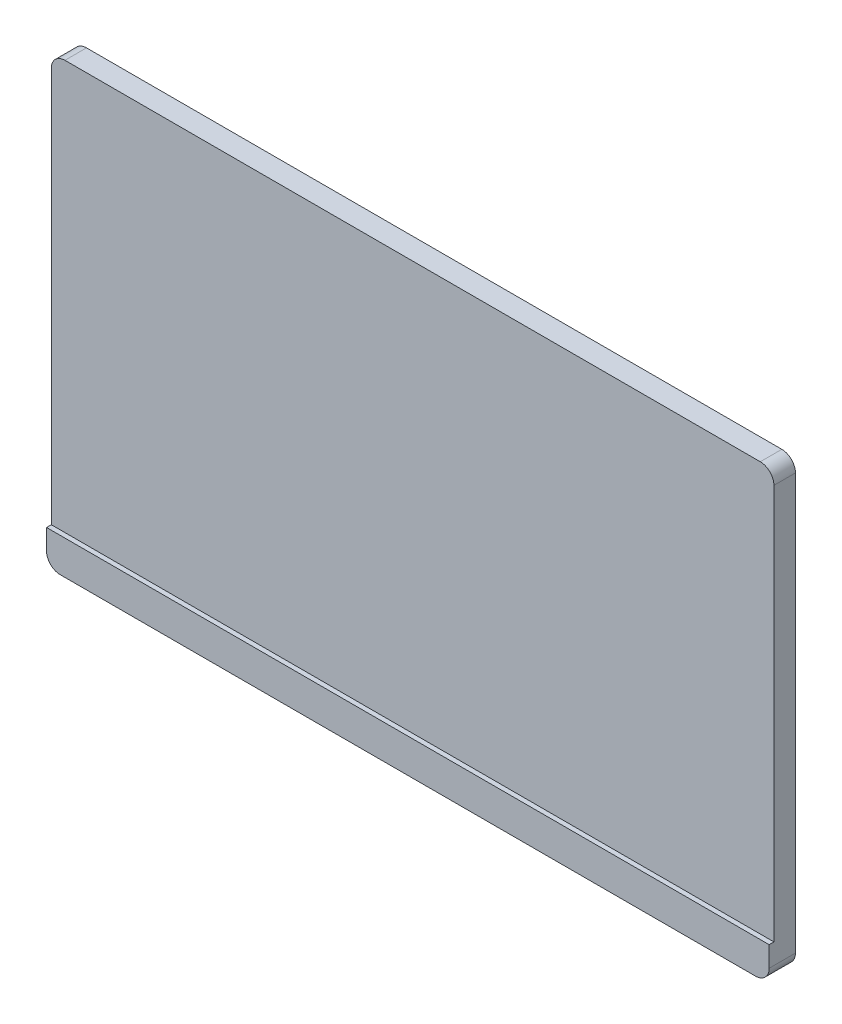
ISO-10303-21;
HEADER;
FILE_DESCRIPTION(('STEP AP214'),'2;1');
FILE_NAME('part.step','',(''),(''),'','','');
FILE_SCHEMA(('AUTOMOTIVE_DESIGN { 1 0 10303 214 1 1 1 1 }'));
ENDSEC;
DATA;
#1=APPLICATION_CONTEXT('core data for automotive mechanical design processes');
#2=APPLICATION_PROTOCOL_DEFINITION('international standard','automotive_design',2000,#1);
#3=PRODUCT_CONTEXT('',#1,'mechanical');
#4=PRODUCT('Part','Part','',(#3));
#5=PRODUCT_RELATED_PRODUCT_CATEGORY('part','',(#4));
#6=PRODUCT_DEFINITION_FORMATION('','',#4);
#7=PRODUCT_DEFINITION_CONTEXT('part definition',#1,'design');
#8=PRODUCT_DEFINITION('design','',#6,#7);
#9=PRODUCT_DEFINITION_SHAPE('','',#8);
#10=(LENGTH_UNIT() NAMED_UNIT(*) SI_UNIT(.MILLI.,.METRE.));
#11=(NAMED_UNIT(*) PLANE_ANGLE_UNIT() SI_UNIT($,.RADIAN.));
#12=(NAMED_UNIT(*) SI_UNIT($,.STERADIAN.) SOLID_ANGLE_UNIT());
#13=UNCERTAINTY_MEASURE_WITH_UNIT(LENGTH_MEASURE(1.E-05),#10,'distance_accuracy_value','');
#14=(GEOMETRIC_REPRESENTATION_CONTEXT(3) GLOBAL_UNCERTAINTY_ASSIGNED_CONTEXT((#13)) GLOBAL_UNIT_ASSIGNED_CONTEXT((#10,
#11,#12)) REPRESENTATION_CONTEXT('',''));
#15=CARTESIAN_POINT('',(0.,0.,0.));
#16=DIRECTION('',(0.,0.,1.));
#17=DIRECTION('',(1.,0.,0.));
#18=AXIS2_PLACEMENT_3D('',#15,#16,#17);
#19=CARTESIAN_POINT('',(0.,0.,15.8));
#20=DIRECTION('',(0.,1.,0.));
#21=DIRECTION('',(0.,0.,1.));
#22=AXIS2_PLACEMENT_3D('',#19,#20,#21);
#23=PLANE('',#22);
#24=CARTESIAN_POINT('',(530.,0.,-111.562410900628));
#25=DIRECTION('',(0.,1.,0.));
#26=DIRECTION('',(0.,0.,-1.));
#27=AXIS2_PLACEMENT_3D('',#24,#25,#26);
#28=CIRCLE('',#27,111.562410900628);
#29=CARTESIAN_POINT('',(475.,0.,-14.4996913531077));
#30=VERTEX_POINT('',#29);
#31=CARTESIAN_POINT('',(520.,0.,-0.44908350035365));
#32=VERTEX_POINT('',#31);
#33=EDGE_CURVE('E178',#30,#32,#28,.T.);
#34=ORIENTED_EDGE('',*,*,#33,.T.);
#35=DIRECTION('',(0.,0.,-1.));
#36=VECTOR('',#35,1.);
#37=CARTESIAN_POINT('',(520.,0.,15.8));
#38=LINE('',#37,#36);
#39=CARTESIAN_POINT('',(520.,0.,19.3));
#40=VERTEX_POINT('',#39);
#41=EDGE_CURVE('E363',#32,#40,#38,.F.);
#42=ORIENTED_EDGE('',*,*,#41,.T.);
#43=DIRECTION('',(1.,0.,0.));
#44=VECTOR('',#43,1.);
#45=CARTESIAN_POINT('',(0.,0.,19.3));
#46=LINE('',#45,#44);
#47=CARTESIAN_POINT('',(10.,0.,19.3));
#48=VERTEX_POINT('',#47);
#49=EDGE_CURVE('E206',#48,#40,#46,.T.);
#50=ORIENTED_EDGE('',*,*,#49,.F.);
#51=DIRECTION('',(0.,0.,-1.));
#52=VECTOR('',#51,1.);
#53=CARTESIAN_POINT('',(10.,0.,15.8));
#54=LINE('',#53,#52);
#55=CARTESIAN_POINT('',(10.,0.,-0.462525831437299));
#56=VERTEX_POINT('',#55);
#57=EDGE_CURVE('E154',#48,#56,#54,.T.);
#58=ORIENTED_EDGE('',*,*,#57,.T.);
#59=CARTESIAN_POINT('',(0.,0.,-108.333333333334));
#60=DIRECTION('',(0.,1.,0.));
#61=DIRECTION('',(0.,0.,1.));
#62=AXIS2_PLACEMENT_3D('',#59,#60,#61);
#63=CIRCLE('',#62,108.333333333333);
#64=CARTESIAN_POINT('',(55.,0.,-15.));
#65=VERTEX_POINT('',#64);
#66=EDGE_CURVE('E145',#56,#65,#63,.T.);
#67=ORIENTED_EDGE('',*,*,#66,.T.);
#68=CARTESIAN_POINT('',(110.,0.,78.3333333333334));
#69=DIRECTION('',(0.,-1.,0.));
#70=DIRECTION('',(0.,0.,-1.));
#71=AXIS2_PLACEMENT_3D('',#68,#69,#70);
#72=CIRCLE('',#71,108.333333333333);
#73=CARTESIAN_POINT('',(110.,0.,-30.));
#74=VERTEX_POINT('',#73);
#75=EDGE_CURVE('E150',#65,#74,#72,.T.);
#76=ORIENTED_EDGE('',*,*,#75,.T.);
#77=DIRECTION('',(-1.,0.,0.));
#78=VECTOR('',#77,1.);
#79=CARTESIAN_POINT('',(530.,0.,-30.));
#80=LINE('',#79,#78);
#81=CARTESIAN_POINT('',(420.,0.,-30.));
#82=VERTEX_POINT('',#81);
#83=EDGE_CURVE('E196',#82,#74,#80,.T.);
#84=ORIENTED_EDGE('',*,*,#83,.F.);
#85=CARTESIAN_POINT('',(415.943924500506,0.,89.7210958066118));
#86=DIRECTION('',(0.,-1.,0.));
#87=DIRECTION('',(0.,0.,1.));
#88=AXIS2_PLACEMENT_3D('',#85,#86,#87);
#89=CIRCLE('',#88,119.78978474642);
#90=EDGE_CURVE('E180',#82,#30,#89,.T.);
#91=ORIENTED_EDGE('',*,*,#90,.T.);
#92=EDGE_LOOP('',(#34,#42,#50,#58,#67,#76,#84,#91));
#93=FACE_BOUND('',#92,.T.);
#94=ADVANCED_FACE('F37',(#93),#23,.F.);
#95=CARTESIAN_POINT('',(530.,220.,-30.));
#96=DIRECTION('',(0.,-1.,0.));
#97=DIRECTION('',(0.,0.,-1.));
#98=AXIS2_PLACEMENT_3D('',#95,#96,#97);
#99=PLANE('',#98);
#100=CARTESIAN_POINT('',(110.,220.,78.3333333333334));
#101=DIRECTION('',(0.,-1.,0.));
#102=DIRECTION('',(0.,0.,-1.));
#103=AXIS2_PLACEMENT_3D('',#100,#101,#102);
#104=CIRCLE('',#103,108.333333333333);
#105=CARTESIAN_POINT('',(55.,220.,-15.));
#106=VERTEX_POINT('',#105);
#107=CARTESIAN_POINT('',(110.,220.,-30.));
#108=VERTEX_POINT('',#107);
#109=EDGE_CURVE('E156',#106,#108,#104,.T.);
#110=ORIENTED_EDGE('',*,*,#109,.F.);
#111=CARTESIAN_POINT('',(0.,220.,-108.333333333334));
#112=DIRECTION('',(0.,1.,0.));
#113=DIRECTION('',(0.,0.,1.));
#114=AXIS2_PLACEMENT_3D('',#111,#112,#113);
#115=CIRCLE('',#114,108.333333333333);
#116=CARTESIAN_POINT('',(0.,220.,0.));
#117=VERTEX_POINT('',#116);
#118=EDGE_CURVE('E163',#117,#106,#115,.T.);
#119=ORIENTED_EDGE('',*,*,#118,.F.);
#120=DIRECTION('',(1.,0.,0.));
#121=VECTOR('',#120,1.);
#122=CARTESIAN_POINT('',(530.,220.,0.));
#123=LINE('',#122,#121);
#124=CARTESIAN_POINT('',(530.,220.,0.));
#125=VERTEX_POINT('',#124);
#126=EDGE_CURVE('E191',#117,#125,#123,.T.);
#127=ORIENTED_EDGE('',*,*,#126,.T.);
#128=CARTESIAN_POINT('',(530.,220.,-111.562410900628));
#129=DIRECTION('',(0.,1.,0.));
#130=DIRECTION('',(0.,0.,-1.));
#131=AXIS2_PLACEMENT_3D('',#128,#129,#130);
#132=CIRCLE('',#131,111.562410900628);
#133=CARTESIAN_POINT('',(475.,220.,-14.4996913531077));
#134=VERTEX_POINT('',#133);
#135=EDGE_CURVE('E176',#134,#125,#132,.T.);
#136=ORIENTED_EDGE('',*,*,#135,.F.);
#137=CARTESIAN_POINT('',(415.943924500506,220.,89.7210958066118));
#138=DIRECTION('',(0.,-1.,0.));
#139=DIRECTION('',(0.,0.,1.));
#140=AXIS2_PLACEMENT_3D('',#137,#138,#139);
#141=CIRCLE('',#140,119.78978474642);
#142=CARTESIAN_POINT('',(420.,220.,-30.));
#143=VERTEX_POINT('',#142);
#144=EDGE_CURVE('E181',#143,#134,#141,.T.);
#145=ORIENTED_EDGE('',*,*,#144,.F.);
#146=DIRECTION('',(1.,0.,0.));
#147=VECTOR('',#146,1.);
#148=CARTESIAN_POINT('',(530.,220.,-30.));
#149=LINE('',#148,#147);
#150=EDGE_CURVE('E198',#108,#143,#149,.T.);
#151=ORIENTED_EDGE('',*,*,#150,.F.);
#152=EDGE_LOOP('',(#110,#119,#127,#136,#145,#151));
#153=FACE_BOUND('',#152,.T.);
#154=ADVANCED_FACE('F265',(#153),#99,.F.);
#155=CARTESIAN_POINT('',(0.,0.,15.8));
#156=DIRECTION('',(0.,0.,-1.));
#157=DIRECTION('',(-1.,0.,0.));
#158=AXIS2_PLACEMENT_3D('',#155,#156,#157);
#159=PLANE('',#158);
#160=DIRECTION('',(-1.,0.,0.));
#161=VECTOR('',#160,1.);
#162=CARTESIAN_POINT('',(0.,325.,15.8));
#163=LINE('',#162,#161);
#164=CARTESIAN_POINT('',(520.,325.,15.8));
#165=VERTEX_POINT('',#164);
#166=CARTESIAN_POINT('',(10.,325.,15.8));
#167=VERTEX_POINT('',#166);
#168=EDGE_CURVE('E227',#165,#167,#163,.T.);
#169=ORIENTED_EDGE('',*,*,#168,.T.);
#170=CARTESIAN_POINT('',(10.,315.,15.8));
#171=DIRECTION('',(0.,0.,-1.));
#172=DIRECTION('',(-1.,0.,0.));
#173=AXIS2_PLACEMENT_3D('',#170,#171,#172);
#174=CIRCLE('',#173,10.);
#175=CARTESIAN_POINT('',(0.,315.,15.8));
#176=VERTEX_POINT('',#175);
#177=EDGE_CURVE('E11',#167,#176,#174,.F.);
#178=ORIENTED_EDGE('',*,*,#177,.T.);
#179=DIRECTION('',(0.,-1.,0.));
#180=VECTOR('',#179,1.);
#181=CARTESIAN_POINT('',(0.,0.,15.8));
#182=LINE('',#181,#180);
#183=CARTESIAN_POINT('',(0.,25.,15.8));
#184=VERTEX_POINT('',#183);
#185=EDGE_CURVE('E222',#176,#184,#182,.T.);
#186=ORIENTED_EDGE('',*,*,#185,.T.);
#187=DIRECTION('',(-1.,0.,0.));
#188=VECTOR('',#187,1.);
#189=CARTESIAN_POINT('',(0.,25.,15.8));
#190=LINE('',#189,#188);
#191=CARTESIAN_POINT('',(530.,25.,15.8));
#192=VERTEX_POINT('',#191);
#193=EDGE_CURVE('E200',#192,#184,#190,.T.);
#194=ORIENTED_EDGE('',*,*,#193,.F.);
#195=DIRECTION('',(0.,1.,0.));
#196=VECTOR('',#195,1.);
#197=CARTESIAN_POINT('',(530.,0.,15.8));
#198=LINE('',#197,#196);
#199=CARTESIAN_POINT('',(530.,315.,15.8));
#200=VERTEX_POINT('',#199);
#201=EDGE_CURVE('E224',#192,#200,#198,.T.);
#202=ORIENTED_EDGE('',*,*,#201,.T.);
#203=CARTESIAN_POINT('',(520.,315.,15.8));
#204=DIRECTION('',(0.,0.,-1.));
#205=DIRECTION('',(-1.,0.,0.));
#206=AXIS2_PLACEMENT_3D('',#203,#204,#205);
#207=CIRCLE('',#206,10.);
#208=EDGE_CURVE('E45',#200,#165,#207,.F.);
#209=ORIENTED_EDGE('',*,*,#208,.T.);
#210=EDGE_LOOP('',(#169,#178,#186,#194,#202,#209));
#211=FACE_BOUND('',#210,.T.);
#212=ADVANCED_FACE('F268',(#211),#159,.F.);
#213=CARTESIAN_POINT('',(0.,0.,15.8));
#214=DIRECTION('',(1.,0.,0.));
#215=DIRECTION('',(0.,0.,-1.));
#216=AXIS2_PLACEMENT_3D('',#213,#214,#215);
#217=PLANE('',#216);
#218=DIRECTION('',(0.,1.,0.));
#219=VECTOR('',#218,1.);
#220=CARTESIAN_POINT('',(0.,0.,0.));
#221=LINE('',#220,#219);
#222=CARTESIAN_POINT('',(0.,10.,0.));
#223=VERTEX_POINT('',#222);
#224=EDGE_CURVE('E174',#223,#117,#221,.T.);
#225=ORIENTED_EDGE('',*,*,#224,.F.);
#226=DIRECTION('',(0.,0.,-1.));
#227=VECTOR('',#226,1.);
#228=CARTESIAN_POINT('',(0.,10.,15.8));
#229=LINE('',#228,#227);
#230=CARTESIAN_POINT('',(0.,10.,19.3));
#231=VERTEX_POINT('',#230);
#232=EDGE_CURVE('E299',#223,#231,#229,.F.);
#233=ORIENTED_EDGE('',*,*,#232,.T.);
#234=DIRECTION('',(0.,-1.,0.));
#235=VECTOR('',#234,1.);
#236=CARTESIAN_POINT('',(0.,0.,19.3));
#237=LINE('',#236,#235);
#238=CARTESIAN_POINT('',(0.,25.,19.3));
#239=VERTEX_POINT('',#238);
#240=EDGE_CURVE('E203',#239,#231,#237,.T.);
#241=ORIENTED_EDGE('',*,*,#240,.F.);
#242=DIRECTION('',(0.,0.,-1.));
#243=VECTOR('',#242,1.);
#244=CARTESIAN_POINT('',(0.,25.,19.3));
#245=LINE('',#244,#243);
#246=EDGE_CURVE('E213',#239,#184,#245,.T.);
#247=ORIENTED_EDGE('',*,*,#246,.T.);
#248=ORIENTED_EDGE('',*,*,#185,.F.);
#249=DIRECTION('',(0.,0.,-1.));
#250=VECTOR('',#249,1.);
#251=CARTESIAN_POINT('',(0.,315.,15.8));
#252=LINE('',#251,#250);
#253=CARTESIAN_POINT('',(0.,315.,0.));
#254=VERTEX_POINT('',#253);
#255=EDGE_CURVE('E308',#176,#254,#252,.T.);
#256=ORIENTED_EDGE('',*,*,#255,.T.);
#257=DIRECTION('',(0.,-1.,0.));
#258=VECTOR('',#257,1.);
#259=CARTESIAN_POINT('',(0.,0.,0.));
#260=LINE('',#259,#258);
#261=EDGE_CURVE('E221',#254,#117,#260,.T.);
#262=ORIENTED_EDGE('',*,*,#261,.T.);
#263=EDGE_LOOP('',(#225,#233,#241,#247,#248,#256,#262));
#264=FACE_BOUND('',#263,.T.);
#265=ADVANCED_FACE('F280',(#264),#217,.F.);
#266=CARTESIAN_POINT('',(530.,0.,15.8));
#267=DIRECTION('',(-1.,0.,0.));
#268=DIRECTION('',(0.,0.,1.));
#269=AXIS2_PLACEMENT_3D('',#266,#267,#268);
#270=PLANE('',#269);
#271=DIRECTION('',(0.,1.,0.));
#272=VECTOR('',#271,1.);
#273=CARTESIAN_POINT('',(530.,0.,19.3));
#274=LINE('',#273,#272);
#275=CARTESIAN_POINT('',(530.,10.,19.3));
#276=VERTEX_POINT('',#275);
#277=CARTESIAN_POINT('',(530.,25.,19.3));
#278=VERTEX_POINT('',#277);
#279=EDGE_CURVE('E209',#276,#278,#274,.T.);
#280=ORIENTED_EDGE('',*,*,#279,.F.);
#281=DIRECTION('',(0.,0.,-1.));
#282=VECTOR('',#281,1.);
#283=CARTESIAN_POINT('',(530.,10.,15.8));
#284=LINE('',#283,#282);
#285=CARTESIAN_POINT('',(530.,10.,0.));
#286=VERTEX_POINT('',#285);
#287=EDGE_CURVE('E236',#276,#286,#284,.T.);
#288=ORIENTED_EDGE('',*,*,#287,.T.);
#289=DIRECTION('',(0.,1.,0.));
#290=VECTOR('',#289,1.);
#291=CARTESIAN_POINT('',(530.,0.,0.));
#292=LINE('',#291,#290);
#293=EDGE_CURVE('E184',#286,#125,#292,.T.);
#294=ORIENTED_EDGE('',*,*,#293,.T.);
#295=DIRECTION('',(0.,1.,0.));
#296=VECTOR('',#295,1.);
#297=CARTESIAN_POINT('',(530.,0.,0.));
#298=LINE('',#297,#296);
#299=CARTESIAN_POINT('',(530.,315.,0.));
#300=VERTEX_POINT('',#299);
#301=EDGE_CURVE('E231',#125,#300,#298,.T.);
#302=ORIENTED_EDGE('',*,*,#301,.T.);
#303=DIRECTION('',(0.,0.,-1.));
#304=VECTOR('',#303,1.);
#305=CARTESIAN_POINT('',(530.,315.,15.8));
#306=LINE('',#305,#304);
#307=EDGE_CURVE('E229',#300,#200,#306,.F.);
#308=ORIENTED_EDGE('',*,*,#307,.T.);
#309=ORIENTED_EDGE('',*,*,#201,.F.);
#310=DIRECTION('',(0.,0.,-1.));
#311=VECTOR('',#310,1.);
#312=CARTESIAN_POINT('',(530.,25.,19.3));
#313=LINE('',#312,#311);
#314=EDGE_CURVE('E218',#278,#192,#313,.T.);
#315=ORIENTED_EDGE('',*,*,#314,.F.);
#316=EDGE_LOOP('',(#280,#288,#294,#302,#308,#309,#315));
#317=FACE_BOUND('',#316,.T.);
#318=ADVANCED_FACE('F287',(#317),#270,.F.);
#319=CARTESIAN_POINT('',(0.,325.,15.8));
#320=DIRECTION('',(0.,-1.,0.));
#321=DIRECTION('',(0.,0.,-1.));
#322=AXIS2_PLACEMENT_3D('',#319,#320,#321);
#323=PLANE('',#322);
#324=DIRECTION('',(-1.,0.,0.));
#325=VECTOR('',#324,1.);
#326=CARTESIAN_POINT('',(0.,325.,0.));
#327=LINE('',#326,#325);
#328=CARTESIAN_POINT('',(520.,325.,0.));
#329=VERTEX_POINT('',#328);
#330=CARTESIAN_POINT('',(10.,325.,0.));
#331=VERTEX_POINT('',#330);
#332=EDGE_CURVE('E225',#329,#331,#327,.T.);
#333=ORIENTED_EDGE('',*,*,#332,.T.);
#334=DIRECTION('',(0.,0.,-1.));
#335=VECTOR('',#334,1.);
#336=CARTESIAN_POINT('',(10.,325.,15.8));
#337=LINE('',#336,#335);
#338=EDGE_CURVE('E52',#331,#167,#337,.F.);
#339=ORIENTED_EDGE('',*,*,#338,.T.);
#340=ORIENTED_EDGE('',*,*,#168,.F.);
#341=DIRECTION('',(0.,0.,-1.));
#342=VECTOR('',#341,1.);
#343=CARTESIAN_POINT('',(520.,325.,15.8));
#344=LINE('',#343,#342);
#345=EDGE_CURVE('E316',#165,#329,#344,.T.);
#346=ORIENTED_EDGE('',*,*,#345,.T.);
#347=EDGE_LOOP('',(#333,#339,#340,#346));
#348=FACE_BOUND('',#347,.T.);
#349=ADVANCED_FACE('F283',(#348),#323,.F.);
#350=CARTESIAN_POINT('',(0.,0.,0.));
#351=DIRECTION('',(0.,0.,-1.));
#352=DIRECTION('',(-1.,0.,0.));
#353=AXIS2_PLACEMENT_3D('',#350,#351,#352);
#354=PLANE('',#353);
#355=ORIENTED_EDGE('',*,*,#261,.F.);
#356=CARTESIAN_POINT('',(10.,315.,0.));
#357=DIRECTION('',(0.,0.,-1.));
#358=DIRECTION('',(-1.,0.,0.));
#359=AXIS2_PLACEMENT_3D('',#356,#357,#358);
#360=CIRCLE('',#359,10.);
#361=EDGE_CURVE('E310',#254,#331,#360,.T.);
#362=ORIENTED_EDGE('',*,*,#361,.T.);
#363=ORIENTED_EDGE('',*,*,#332,.F.);
#364=CARTESIAN_POINT('',(520.,315.,0.));
#365=DIRECTION('',(0.,0.,-1.));
#366=DIRECTION('',(-1.,0.,0.));
#367=AXIS2_PLACEMENT_3D('',#364,#365,#366);
#368=CIRCLE('',#367,10.);
#369=EDGE_CURVE('E307',#329,#300,#368,.T.);
#370=ORIENTED_EDGE('',*,*,#369,.T.);
#371=ORIENTED_EDGE('',*,*,#301,.F.);
#372=ORIENTED_EDGE('',*,*,#126,.F.);
#373=EDGE_LOOP('',(#355,#362,#363,#370,#371,#372));
#374=FACE_BOUND('',#373,.T.);
#375=ADVANCED_FACE('F276',(#374),#354,.T.);
#376=CARTESIAN_POINT('',(0.,25.,19.3));
#377=DIRECTION('',(0.,-1.,0.));
#378=DIRECTION('',(0.,0.,-1.));
#379=AXIS2_PLACEMENT_3D('',#376,#377,#378);
#380=PLANE('',#379);
#381=ORIENTED_EDGE('',*,*,#193,.T.);
#382=ORIENTED_EDGE('',*,*,#246,.F.);
#383=DIRECTION('',(-1.,0.,0.));
#384=VECTOR('',#383,1.);
#385=CARTESIAN_POINT('',(0.,25.,19.3));
#386=LINE('',#385,#384);
#387=EDGE_CURVE('E211',#278,#239,#386,.T.);
#388=ORIENTED_EDGE('',*,*,#387,.F.);
#389=ORIENTED_EDGE('',*,*,#314,.T.);
#390=EDGE_LOOP('',(#381,#382,#388,#389));
#391=FACE_BOUND('',#390,.T.);
#392=ADVANCED_FACE('F272',(#391),#380,.F.);
#393=CARTESIAN_POINT('',(0.,0.,19.3));
#394=DIRECTION('',(0.,0.,-1.));
#395=DIRECTION('',(-1.,0.,0.));
#396=AXIS2_PLACEMENT_3D('',#393,#394,#395);
#397=PLANE('',#396);
#398=ORIENTED_EDGE('',*,*,#49,.T.);
#399=CARTESIAN_POINT('',(520.,10.,19.3));
#400=DIRECTION('',(0.,0.,-1.));
#401=DIRECTION('',(-1.,0.,0.));
#402=AXIS2_PLACEMENT_3D('',#399,#400,#401);
#403=CIRCLE('',#402,10.);
#404=EDGE_CURVE('E349',#40,#276,#403,.F.);
#405=ORIENTED_EDGE('',*,*,#404,.T.);
#406=ORIENTED_EDGE('',*,*,#279,.T.);
#407=ORIENTED_EDGE('',*,*,#387,.T.);
#408=ORIENTED_EDGE('',*,*,#240,.T.);
#409=CARTESIAN_POINT('',(10.,10.,19.3));
#410=DIRECTION('',(0.,0.,-1.));
#411=DIRECTION('',(-1.,0.,0.));
#412=AXIS2_PLACEMENT_3D('',#409,#410,#411);
#413=CIRCLE('',#412,10.);
#414=EDGE_CURVE('E306',#231,#48,#413,.F.);
#415=ORIENTED_EDGE('',*,*,#414,.T.);
#416=EDGE_LOOP('',(#398,#405,#406,#407,#408,#415));
#417=FACE_BOUND('',#416,.T.);
#418=ADVANCED_FACE('F263',(#417),#397,.F.);
#419=CARTESIAN_POINT('',(0.,0.,-30.));
#420=DIRECTION('',(0.,0.,-1.));
#421=DIRECTION('',(-1.,0.,0.));
#422=AXIS2_PLACEMENT_3D('',#419,#420,#421);
#423=PLANE('',#422);
#424=DIRECTION('',(0.,1.,0.));
#425=VECTOR('',#424,1.);
#426=CARTESIAN_POINT('',(110.,0.,-30.));
#427=LINE('',#426,#425);
#428=EDGE_CURVE('E166',#74,#108,#427,.T.);
#429=ORIENTED_EDGE('',*,*,#428,.T.);
#430=ORIENTED_EDGE('',*,*,#150,.T.);
#431=DIRECTION('',(0.,1.,0.));
#432=VECTOR('',#431,1.);
#433=CARTESIAN_POINT('',(420.,0.,-30.));
#434=LINE('',#433,#432);
#435=EDGE_CURVE('E192',#82,#143,#434,.T.);
#436=ORIENTED_EDGE('',*,*,#435,.F.);
#437=ORIENTED_EDGE('',*,*,#83,.T.);
#438=EDGE_LOOP('',(#429,#430,#436,#437));
#439=FACE_BOUND('',#438,.T.);
#440=ADVANCED_FACE('F258',(#439),#423,.T.);
#441=CARTESIAN_POINT('',(530.,0.,-111.562410900628));
#442=DIRECTION('',(0.,1.,0.));
#443=DIRECTION('',(0.,0.,1.));
#444=AXIS2_PLACEMENT_3D('',#441,#442,#443);
#445=CYLINDRICAL_SURFACE('',#444,111.562410900628);
#446=ORIENTED_EDGE('',*,*,#293,.F.);
#447=CARTESIAN_POINT('',(530.,10.,0.));
#448=CARTESIAN_POINT('',(530.000030234145,9.71876178963356,-8.0107129099506E-06));
#449=CARTESIAN_POINT('',(529.988137029066,9.43752791975248,-2.51557451171749E-07));
#450=CARTESIAN_POINT('',(529.940722104169,8.87707193092216,-1.10893955058909E-05));
#451=CARTESIAN_POINT('',(529.905201509758,8.5978497167951,-2.9685133744754E-05));
#452=CARTESIAN_POINT('',(529.810785151229,8.04359851751822,-0.000151073354512447));
#453=CARTESIAN_POINT('',(529.751906740338,7.76856657644889,-0.000253803391302488));
#454=CARTESIAN_POINT('',(529.611203050304,7.22444039021884,-0.000655171990514546));
#455=CARTESIAN_POINT('',(529.529378051414,6.95534607258312,-0.000953808160325084));
#456=CARTESIAN_POINT('',(529.343314826593,6.42487571711481,-0.00189399124878286));
#457=CARTESIAN_POINT('',(529.239065821297,6.1635034602953,-0.00253570330738098));
#458=CARTESIAN_POINT('',(529.008917943086,5.65046645578527,-0.0043429760018926));
#459=CARTESIAN_POINT('',(528.883018621782,5.39880190927828,-0.00550854748799231));
#460=CARTESIAN_POINT('',(528.610492901704,4.90702176778365,-0.0085703045235026));
#461=CARTESIAN_POINT('',(528.46387027307,4.66690408273017,-0.0104663572863209));
#462=CARTESIAN_POINT('',(528.150926982605,4.19987930423216,-0.0152149117300392));
#463=CARTESIAN_POINT('',(527.984606434115,3.97297213478525,-0.0180674079077164));
#464=CARTESIAN_POINT('',(527.633514657863,3.5340580995594,-0.024963919340166));
#465=CARTESIAN_POINT('',(527.448749749513,3.32204617249719,-0.0290075274158131));
#466=CARTESIAN_POINT('',(527.06204401819,2.91434731499418,-0.0385240571992597));
#467=CARTESIAN_POINT('',(526.860103219266,2.71866036169638,-0.0439969769058));
#468=CARTESIAN_POINT('',(526.440457598764,2.34497187608917,-0.0566027799384922));
#469=CARTESIAN_POINT('',(526.222750067866,2.16697339585293,-0.0637359490266396));
#470=CARTESIAN_POINT('',(525.773171337782,1.8299684704806,-0.0798740210551024));
#471=CARTESIAN_POINT('',(525.541300369219,1.67096171622587,-0.0888788935241175));
#472=CARTESIAN_POINT('',(525.065349903168,1.37324369551325,-0.108934483781986));
#473=CARTESIAN_POINT('',(524.821285505413,1.2345081231353,-0.119982714868154));
#474=CARTESIAN_POINT('',(524.322454864312,0.978080259350731,-0.144282390757111));
#475=CARTESIAN_POINT('',(524.067688798649,0.860387618733938,-0.157533798990848));
#476=CARTESIAN_POINT('',(523.54937759601,0.646903018709766,-0.186343890771924));
#477=CARTESIAN_POINT('',(523.285836084957,0.551102139406357,-0.201901630318777));
#478=CARTESIAN_POINT('',(522.751882478169,0.382016769759189,-0.235379430805156));
#479=CARTESIAN_POINT('',(522.481472005101,0.308727014154632,-0.253298937933344));
#480=CARTESIAN_POINT('',(521.845954272511,0.164836455934771,-0.297794794854094));
#481=CARTESIAN_POINT('',(521.478868523502,0.102996427103422,-0.32528310326219));
#482=CARTESIAN_POINT('',(520.925504870816,0.0411888963158076,-0.369518103635802));
#483=CARTESIAN_POINT('',(520.740690285503,0.0257451377570675,-0.384754915257716));
#484=CARTESIAN_POINT('',(520.37058509688,0.00515205242128874,-0.416199102621977));
#485=CARTESIAN_POINT('',(520.185294531642,1.92647478061249E-06,-0.432406402917606));
#486=CARTESIAN_POINT('',(520.,0.,-0.449083500353638));
#487=B_SPLINE_CURVE_WITH_KNOTS('',3,(#447,#448,#449,#450,#451,#452,#453,#454,#455,#456,#457,
#458,#459,#460,#461,#462,#463,#464,#465,#466,#467,#468,#469,#470,#471,#472,#473,#474,#475,#476,
#477,#478,#479,#480,#481,#482,#483,#484,#485,#486),.UNSPECIFIED.,.F.,.F.,(4,2,2,2,2,2,2,2,2,2,2,
2,2,2,2,2,2,2,2,4),(0.,0.843457147314316,1.68687412240129,2.5296656674652,3.3724469196651,
4.21563421126556,5.05883896778173,5.90189051914285,6.74493721980305,7.5876960604936,
8.43045372119668,9.27335654469271,10.1162456468192,10.9581156497745,11.7999716804913,
12.6414840791374,13.4827995012897,14.599966802087,15.1579764681839,15.7159428102542),.UNSPECIFIED.);
#488=EDGE_CURVE('E239',#286,#32,#487,.T.);
#489=ORIENTED_EDGE('',*,*,#488,.T.);
#490=ORIENTED_EDGE('',*,*,#33,.F.);
#491=DIRECTION('',(0.,1.,0.));
#492=VECTOR('',#491,1.);
#493=CARTESIAN_POINT('',(475.,0.,-14.4996913531077));
#494=LINE('',#493,#492);
#495=EDGE_CURVE('E189',#30,#134,#494,.T.);
#496=ORIENTED_EDGE('',*,*,#495,.T.);
#497=ORIENTED_EDGE('',*,*,#135,.T.);
#498=EDGE_LOOP('',(#446,#489,#490,#496,#497));
#499=FACE_BOUND('',#498,.T.);
#500=ADVANCED_FACE('F252',(#499),#445,.F.);
#501=CARTESIAN_POINT('',(415.943924500506,0.,89.7210958066118));
#502=DIRECTION('',(0.,1.,0.));
#503=DIRECTION('',(0.,0.,1.));
#504=AXIS2_PLACEMENT_3D('',#501,#502,#503);
#505=CYLINDRICAL_SURFACE('',#504,119.78978474642);
#506=ORIENTED_EDGE('',*,*,#144,.T.);
#507=ORIENTED_EDGE('',*,*,#495,.F.);
#508=ORIENTED_EDGE('',*,*,#90,.F.);
#509=ORIENTED_EDGE('',*,*,#435,.T.);
#510=EDGE_LOOP('',(#506,#507,#508,#509));
#511=FACE_BOUND('',#510,.T.);
#512=ADVANCED_FACE('F257',(#511),#505,.T.);
#513=CARTESIAN_POINT('',(0.,0.,-108.333333333334));
#514=DIRECTION('',(0.,1.,0.));
#515=DIRECTION('',(0.,0.,1.));
#516=AXIS2_PLACEMENT_3D('',#513,#514,#515);
#517=CYLINDRICAL_SURFACE('',#516,108.333333333333);
#518=ORIENTED_EDGE('',*,*,#66,.F.);
#519=CARTESIAN_POINT('',(10.,0.,-0.462525831437299));
#520=CARTESIAN_POINT('',(9.72005606173837,-3.05384339891051E-05,-0.436563059285736));
#521=CARTESIAN_POINT('',(9.44000935133854,0.0117541170602697,-0.411711500965983));
#522=CARTESIAN_POINT('',(8.88170062815502,0.0587867178277562,-0.364336129349959));
#523=CARTESIAN_POINT('',(8.60343857943176,0.0940341890985903,-0.341812269039499));
#524=CARTESIAN_POINT('',(8.05086981675711,0.187792780151293,-0.29921134550139));
#525=CARTESIAN_POINT('',(7.77656049107078,0.24628773306202,-0.27913259453481));
#526=CARTESIAN_POINT('',(7.23367145570555,0.386156541561324,-0.241432137926462));
#527=CARTESIAN_POINT('',(6.96509162542393,0.467529915059426,-0.223810380523015));
#528=CARTESIAN_POINT('',(6.43542409202535,0.652671165514605,-0.190987801726162));
#529=CARTESIAN_POINT('',(6.17434113635157,0.756452893169259,-0.175788487800391));
#530=CARTESIAN_POINT('',(5.66172176571528,0.985668504402939,-0.147743183955006));
#531=CARTESIAN_POINT('',(5.41018554191611,1.11110282127374,-0.134897241139504));
#532=CARTESIAN_POINT('',(4.91853900463798,1.38271452494768,-0.111433288453592));
#533=CARTESIAN_POINT('',(4.67842612289679,1.52888721951755,-0.100814775951578));
#534=CARTESIAN_POINT('',(4.21130089414753,1.84096442743966,-0.0816326090141025));
#535=CARTESIAN_POINT('',(3.98428844906693,2.00686879304813,-0.073068939194155));
#536=CARTESIAN_POINT('',(3.54549072937147,2.35684030870092,-0.0578111466944807));
#537=CARTESIAN_POINT('',(3.33367250852297,2.54086597302475,-0.0511128822355768));
#538=CARTESIAN_POINT('',(2.92622134861878,2.92608606094317,-0.0393358533066301));
#539=CARTESIAN_POINT('',(2.73058841501272,3.12728049031849,-0.034257089381875));
#540=CARTESIAN_POINT('',(2.35686414848395,3.54545688910747,-0.025479238215457));
#541=CARTESIAN_POINT('',(2.17877664593138,3.76244228797476,-0.0217804517497919));
#542=CARTESIAN_POINT('',(1.84146281895041,4.21061906412862,-0.0155204329649518));
#543=CARTESIAN_POINT('',(1.68223623566748,4.44181024638338,-0.0129591850324322));
#544=CARTESIAN_POINT('',(1.3835982636317,4.91704137115435,-0.00873268802343598));
#545=CARTESIAN_POINT('',(1.24421029152943,5.16109603933098,-0.0070684914377883));
#546=CARTESIAN_POINT('',(0.986464495747591,5.66006517330921,-0.00441468207466537));
#547=CARTESIAN_POINT('',(0.868106426586554,5.91497951230311,-0.00342506142250134));
#548=CARTESIAN_POINT('',(0.65330571121115,6.43375976466614,-0.00191660805219008));
#549=CARTESIAN_POINT('',(0.556853342826239,6.69762164694789,-0.00139756617491684));
#550=CARTESIAN_POINT('',(0.386504847152479,7.23241930015862,-0.000656115843796999));
#551=CARTESIAN_POINT('',(0.312603456587608,7.50335340441991,-0.000433638132587566));
#552=CARTESIAN_POINT('',(0.167118733755703,8.14149381406287,-9.62566209690374E-05));
#553=CARTESIAN_POINT('',(0.104453744252995,8.51079410091561,-4.16048470993354E-05));
#554=CARTESIAN_POINT('',(0.0417930603970099,9.06777316032696,-6.3964208794118E-06));
#555=CARTESIAN_POINT('',(0.0261289823880811,9.25383441336476,-2.44448733372474E-06));
#556=CARTESIAN_POINT('',(0.00523233427669889,9.62658123358134,1.74758578161597E-07));
#557=CARTESIAN_POINT('',(1.96484994123685E-06,9.81326692415085,-1.15904374483481E-06));
#558=CARTESIAN_POINT('',(0.,10.,0.));
#559=B_SPLINE_CURVE_WITH_KNOTS('',3,(#519,#520,#521,#522,#523,#524,#525,#526,#527,#528,#529,
#530,#531,#532,#533,#534,#535,#536,#537,#538,#539,#540,#541,#542,#543,#544,#545,#546,#547,#548,
#549,#550,#551,#552,#553,#554,#555,#556,#557,#558),.UNSPECIFIED.,.F.,.F.,(4,2,2,2,2,2,2,2,2,2,2,
2,2,2,2,2,2,2,2,4),(0.,0.843186625684766,1.68635621759348,2.52894047176394,3.37150697246224,
4.21459576557301,5.05770143176045,5.90061664148203,6.74352554015038,7.58454772099213,
8.42557018500679,9.2667758489685,10.1079699665611,10.9501489024489,11.7923180069593,
12.6341126070463,13.4757105862988,14.5967688857067,15.1566822286946,15.7167136560097),.UNSPECIFIED.);
#560=EDGE_CURVE('E305',#56,#223,#559,.T.);
#561=ORIENTED_EDGE('',*,*,#560,.T.);
#562=ORIENTED_EDGE('',*,*,#224,.T.);
#563=ORIENTED_EDGE('',*,*,#118,.T.);
#564=DIRECTION('',(0.,1.,0.));
#565=VECTOR('',#564,1.);
#566=CARTESIAN_POINT('',(55.,0.,-15.));
#567=LINE('',#566,#565);
#568=EDGE_CURVE('E159',#65,#106,#567,.T.);
#569=ORIENTED_EDGE('',*,*,#568,.F.);
#570=EDGE_LOOP('',(#518,#561,#562,#563,#569));
#571=FACE_BOUND('',#570,.T.);
#572=ADVANCED_FACE('F160',(#571),#517,.F.);
#573=CARTESIAN_POINT('',(110.,0.,78.3333333333334));
#574=DIRECTION('',(0.,1.,0.));
#575=DIRECTION('',(0.,0.,1.));
#576=AXIS2_PLACEMENT_3D('',#573,#574,#575);
#577=CYLINDRICAL_SURFACE('',#576,108.333333333333);
#578=ORIENTED_EDGE('',*,*,#109,.T.);
#579=ORIENTED_EDGE('',*,*,#428,.F.);
#580=ORIENTED_EDGE('',*,*,#75,.F.);
#581=ORIENTED_EDGE('',*,*,#568,.T.);
#582=EDGE_LOOP('',(#578,#579,#580,#581));
#583=FACE_BOUND('',#582,.T.);
#584=ADVANCED_FACE('F168',(#583),#577,.T.);
#585=CARTESIAN_POINT('',(520.,10.,15.8));
#586=DIRECTION('',(0.,0.,-1.));
#587=DIRECTION('',(-1.,0.,0.));
#588=AXIS2_PLACEMENT_3D('',#585,#586,#587);
#589=CYLINDRICAL_SURFACE('',#588,10.);
#590=ORIENTED_EDGE('',*,*,#404,.F.);
#591=ORIENTED_EDGE('',*,*,#41,.F.);
#592=ORIENTED_EDGE('',*,*,#488,.F.);
#593=ORIENTED_EDGE('',*,*,#287,.F.);
#594=EDGE_LOOP('',(#590,#591,#592,#593));
#595=FACE_BOUND('',#594,.T.);
#596=ADVANCED_FACE('F248',(#595),#589,.T.);
#597=CARTESIAN_POINT('',(10.,10.,15.8));
#598=DIRECTION('',(0.,0.,-1.));
#599=DIRECTION('',(-1.,0.,0.));
#600=AXIS2_PLACEMENT_3D('',#597,#598,#599);
#601=CYLINDRICAL_SURFACE('',#600,10.);
#602=ORIENTED_EDGE('',*,*,#414,.F.);
#603=ORIENTED_EDGE('',*,*,#232,.F.);
#604=ORIENTED_EDGE('',*,*,#560,.F.);
#605=ORIENTED_EDGE('',*,*,#57,.F.);
#606=EDGE_LOOP('',(#602,#603,#604,#605));
#607=FACE_BOUND('',#606,.T.);
#608=ADVANCED_FACE('F304',(#607),#601,.T.);
#609=CARTESIAN_POINT('',(10.,315.,15.8));
#610=DIRECTION('',(0.,0.,-1.));
#611=DIRECTION('',(-1.,0.,0.));
#612=AXIS2_PLACEMENT_3D('',#609,#610,#611);
#613=CYLINDRICAL_SURFACE('',#612,10.);
#614=ORIENTED_EDGE('',*,*,#177,.F.);
#615=ORIENTED_EDGE('',*,*,#338,.F.);
#616=ORIENTED_EDGE('',*,*,#361,.F.);
#617=ORIENTED_EDGE('',*,*,#255,.F.);
#618=EDGE_LOOP('',(#614,#615,#616,#617));
#619=FACE_BOUND('',#618,.T.);
#620=ADVANCED_FACE('F327',(#619),#613,.T.);
#621=CARTESIAN_POINT('',(520.,315.,15.8));
#622=DIRECTION('',(0.,0.,-1.));
#623=DIRECTION('',(-1.,0.,0.));
#624=AXIS2_PLACEMENT_3D('',#621,#622,#623);
#625=CYLINDRICAL_SURFACE('',#624,10.);
#626=ORIENTED_EDGE('',*,*,#208,.F.);
#627=ORIENTED_EDGE('',*,*,#307,.F.);
#628=ORIENTED_EDGE('',*,*,#369,.F.);
#629=ORIENTED_EDGE('',*,*,#345,.F.);
#630=EDGE_LOOP('',(#626,#627,#628,#629));
#631=FACE_BOUND('',#630,.T.);
#632=ADVANCED_FACE('F39',(#631),#625,.T.);
#633=CLOSED_SHELL('',(#94,#154,#212,#265,#318,#349,#375,#392,#418,#440,#500,#512,#572,#584,#596,
#608,#620,#632));
#634=MANIFOLD_SOLID_BREP('B2',#633);
#635=ADVANCED_BREP_SHAPE_REPRESENTATION('',(#18,#634),#14);
#636=SHAPE_DEFINITION_REPRESENTATION(#9,#635);
ENDSEC;
END-ISO-10303-21;
